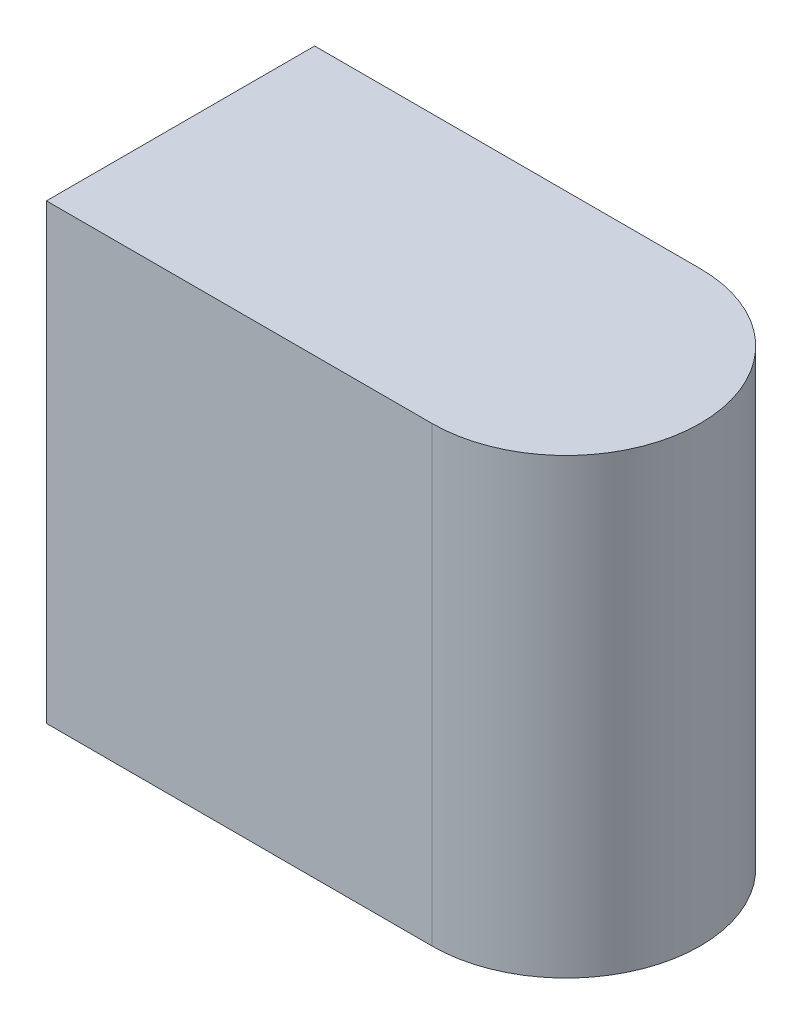
ISO-10303-21;
HEADER;
FILE_DESCRIPTION(('STEP AP214'),'2;1');
FILE_NAME('part.step','',(''),(''),'','','');
FILE_SCHEMA(('AUTOMOTIVE_DESIGN { 1 0 10303 214 1 1 1 1 }'));
ENDSEC;
DATA;
#1=APPLICATION_CONTEXT('core data for automotive mechanical design processes');
#2=APPLICATION_PROTOCOL_DEFINITION('international standard','automotive_design',2000,#1);
#3=PRODUCT_CONTEXT('',#1,'mechanical');
#4=PRODUCT('Part','Part','',(#3));
#5=PRODUCT_RELATED_PRODUCT_CATEGORY('part','',(#4));
#6=PRODUCT_DEFINITION_FORMATION('','',#4);
#7=PRODUCT_DEFINITION_CONTEXT('part definition',#1,'design');
#8=PRODUCT_DEFINITION('design','',#6,#7);
#9=PRODUCT_DEFINITION_SHAPE('','',#8);
#10=(LENGTH_UNIT() NAMED_UNIT(*) SI_UNIT(.MILLI.,.METRE.));
#11=(NAMED_UNIT(*) PLANE_ANGLE_UNIT() SI_UNIT($,.RADIAN.));
#12=(NAMED_UNIT(*) SI_UNIT($,.STERADIAN.) SOLID_ANGLE_UNIT());
#13=UNCERTAINTY_MEASURE_WITH_UNIT(LENGTH_MEASURE(1.E-05),#10,'distance_accuracy_value','');
#14=(GEOMETRIC_REPRESENTATION_CONTEXT(3) GLOBAL_UNCERTAINTY_ASSIGNED_CONTEXT((#13)) GLOBAL_UNIT_ASSIGNED_CONTEXT((#10,
#11,#12)) REPRESENTATION_CONTEXT('',''));
#15=CARTESIAN_POINT('',(0.,0.,0.));
#16=DIRECTION('',(0.,0.,1.));
#17=DIRECTION('',(1.,0.,0.));
#18=AXIS2_PLACEMENT_3D('',#15,#16,#17);
#19=CARTESIAN_POINT('',(11.5,13.5,0.));
#20=DIRECTION('',(0.,0.,-1.));
#21=DIRECTION('',(-1.,0.,0.));
#22=AXIS2_PLACEMENT_3D('',#19,#20,#21);
#23=PLANE('',#22);
#24=DIRECTION('',(1.,0.,0.));
#25=VECTOR('',#24,1.);
#26=CARTESIAN_POINT('',(11.5,0.,0.));
#27=LINE('',#26,#25);
#28=CARTESIAN_POINT('',(0.,0.,0.));
#29=VERTEX_POINT('',#28);
#30=CARTESIAN_POINT('',(11.5,0.,0.));
#31=VERTEX_POINT('',#30);
#32=EDGE_CURVE('E107',#29,#31,#27,.T.);
#33=ORIENTED_EDGE('',*,*,#32,.T.);
#34=DIRECTION('',(0.,-1.,0.));
#35=VECTOR('',#34,1.);
#36=CARTESIAN_POINT('',(11.5,13.5,0.));
#37=LINE('',#36,#35);
#38=CARTESIAN_POINT('',(11.5,13.5,0.));
#39=VERTEX_POINT('',#38);
#40=EDGE_CURVE('E11',#39,#31,#37,.T.);
#41=ORIENTED_EDGE('',*,*,#40,.F.);
#42=DIRECTION('',(1.,0.,0.));
#43=VECTOR('',#42,1.);
#44=CARTESIAN_POINT('',(11.5,13.5,0.));
#45=LINE('',#44,#43);
#46=CARTESIAN_POINT('',(0.,13.5,0.));
#47=VERTEX_POINT('',#46);
#48=EDGE_CURVE('E91',#47,#39,#45,.T.);
#49=ORIENTED_EDGE('',*,*,#48,.F.);
#50=DIRECTION('',(0.,-1.,0.));
#51=VECTOR('',#50,1.);
#52=CARTESIAN_POINT('',(0.,13.5,0.));
#53=LINE('',#52,#51);
#54=EDGE_CURVE('E103',#47,#29,#53,.T.);
#55=ORIENTED_EDGE('',*,*,#54,.T.);
#56=EDGE_LOOP('',(#33,#41,#49,#55));
#57=FACE_BOUND('',#56,.T.);
#58=ADVANCED_FACE('F39',(#57),#23,.F.);
#59=CARTESIAN_POINT('',(11.5,13.5,-4.));
#60=DIRECTION('',(0.,-1.,0.));
#61=DIRECTION('',(0.,0.,-1.));
#62=AXIS2_PLACEMENT_3D('',#59,#60,#61);
#63=CYLINDRICAL_SURFACE('',#62,4.);
#64=CARTESIAN_POINT('',(11.5,0.,-4.));
#65=DIRECTION('',(0.,1.,0.));
#66=DIRECTION('',(0.,0.,-1.));
#67=AXIS2_PLACEMENT_3D('',#64,#65,#66);
#68=CIRCLE('',#67,4.);
#69=CARTESIAN_POINT('',(11.5,0.,-8.));
#70=VERTEX_POINT('',#69);
#71=EDGE_CURVE('E96',#31,#70,#68,.T.);
#72=ORIENTED_EDGE('',*,*,#71,.T.);
#73=DIRECTION('',(0.,-1.,0.));
#74=VECTOR('',#73,1.);
#75=CARTESIAN_POINT('',(11.5,13.5,-8.));
#76=LINE('',#75,#74);
#77=CARTESIAN_POINT('',(11.5,13.5,-8.));
#78=VERTEX_POINT('',#77);
#79=EDGE_CURVE('E48',#78,#70,#76,.T.);
#80=ORIENTED_EDGE('',*,*,#79,.F.);
#81=CARTESIAN_POINT('',(11.5,13.5,-4.));
#82=DIRECTION('',(0.,1.,0.));
#83=DIRECTION('',(0.,0.,-1.));
#84=AXIS2_PLACEMENT_3D('',#81,#82,#83);
#85=CIRCLE('',#84,4.);
#86=EDGE_CURVE('E86',#39,#78,#85,.T.);
#87=ORIENTED_EDGE('',*,*,#86,.F.);
#88=ORIENTED_EDGE('',*,*,#40,.T.);
#89=EDGE_LOOP('',(#72,#80,#87,#88));
#90=FACE_BOUND('',#89,.T.);
#91=ADVANCED_FACE('F95',(#90),#63,.T.);
#92=CARTESIAN_POINT('',(0.,13.5,-8.));
#93=DIRECTION('',(0.,0.,1.));
#94=DIRECTION('',(1.,0.,0.));
#95=AXIS2_PLACEMENT_3D('',#92,#93,#94);
#96=PLANE('',#95);
#97=DIRECTION('',(-1.,0.,0.));
#98=VECTOR('',#97,1.);
#99=CARTESIAN_POINT('',(0.,0.,-8.));
#100=LINE('',#99,#98);
#101=CARTESIAN_POINT('',(0.,0.,-8.));
#102=VERTEX_POINT('',#101);
#103=EDGE_CURVE('E73',#70,#102,#100,.T.);
#104=ORIENTED_EDGE('',*,*,#103,.T.);
#105=DIRECTION('',(0.,-1.,0.));
#106=VECTOR('',#105,1.);
#107=CARTESIAN_POINT('',(0.,13.5,-8.));
#108=LINE('',#107,#106);
#109=CARTESIAN_POINT('',(0.,13.5,-8.));
#110=VERTEX_POINT('',#109);
#111=EDGE_CURVE('E98',#110,#102,#108,.T.);
#112=ORIENTED_EDGE('',*,*,#111,.F.);
#113=DIRECTION('',(-1.,0.,0.));
#114=VECTOR('',#113,1.);
#115=CARTESIAN_POINT('',(0.,13.5,-8.));
#116=LINE('',#115,#114);
#117=EDGE_CURVE('E89',#78,#110,#116,.T.);
#118=ORIENTED_EDGE('',*,*,#117,.F.);
#119=ORIENTED_EDGE('',*,*,#79,.T.);
#120=EDGE_LOOP('',(#104,#112,#118,#119));
#121=FACE_BOUND('',#120,.T.);
#122=ADVANCED_FACE('F99',(#121),#96,.F.);
#123=CARTESIAN_POINT('',(0.,13.5,0.));
#124=DIRECTION('',(1.,0.,0.));
#125=DIRECTION('',(0.,0.,-1.));
#126=AXIS2_PLACEMENT_3D('',#123,#124,#125);
#127=PLANE('',#126);
#128=DIRECTION('',(0.,0.,1.));
#129=VECTOR('',#128,1.);
#130=CARTESIAN_POINT('',(0.,0.,0.));
#131=LINE('',#130,#129);
#132=EDGE_CURVE('E79',#102,#29,#131,.T.);
#133=ORIENTED_EDGE('',*,*,#132,.T.);
#134=ORIENTED_EDGE('',*,*,#54,.F.);
#135=DIRECTION('',(0.,0.,1.));
#136=VECTOR('',#135,1.);
#137=CARTESIAN_POINT('',(0.,13.5,0.));
#138=LINE('',#137,#136);
#139=EDGE_CURVE('E56',#110,#47,#138,.T.);
#140=ORIENTED_EDGE('',*,*,#139,.F.);
#141=ORIENTED_EDGE('',*,*,#111,.T.);
#142=EDGE_LOOP('',(#133,#134,#140,#141));
#143=FACE_BOUND('',#142,.T.);
#144=ADVANCED_FACE('F120',(#143),#127,.F.);
#145=CARTESIAN_POINT('',(11.5,13.5,-4.));
#146=DIRECTION('',(0.,-1.,0.));
#147=DIRECTION('',(0.,0.,-1.));
#148=AXIS2_PLACEMENT_3D('',#145,#146,#147);
#149=PLANE('',#148);
#150=ORIENTED_EDGE('',*,*,#48,.T.);
#151=ORIENTED_EDGE('',*,*,#86,.T.);
#152=ORIENTED_EDGE('',*,*,#117,.T.);
#153=ORIENTED_EDGE('',*,*,#139,.T.);
#154=EDGE_LOOP('',(#150,#151,#152,#153));
#155=FACE_BOUND('',#154,.T.);
#156=ADVANCED_FACE('F87',(#155),#149,.F.);
#157=CARTESIAN_POINT('',(11.5,0.,-4.));
#158=DIRECTION('',(0.,-1.,0.));
#159=DIRECTION('',(0.,0.,-1.));
#160=AXIS2_PLACEMENT_3D('',#157,#158,#159);
#161=PLANE('',#160);
#162=ORIENTED_EDGE('',*,*,#32,.F.);
#163=ORIENTED_EDGE('',*,*,#132,.F.);
#164=ORIENTED_EDGE('',*,*,#103,.F.);
#165=ORIENTED_EDGE('',*,*,#71,.F.);
#166=EDGE_LOOP('',(#162,#163,#164,#165));
#167=FACE_BOUND('',#166,.T.);
#168=ADVANCED_FACE('F123',(#167),#161,.T.);
#169=CLOSED_SHELL('',(#58,#91,#122,#144,#156,#168));
#170=MANIFOLD_SOLID_BREP('B2',#169);
#171=ADVANCED_BREP_SHAPE_REPRESENTATION('',(#18,#170),#14);
#172=SHAPE_DEFINITION_REPRESENTATION(#9,#171);
ENDSEC;
END-ISO-10303-21;
